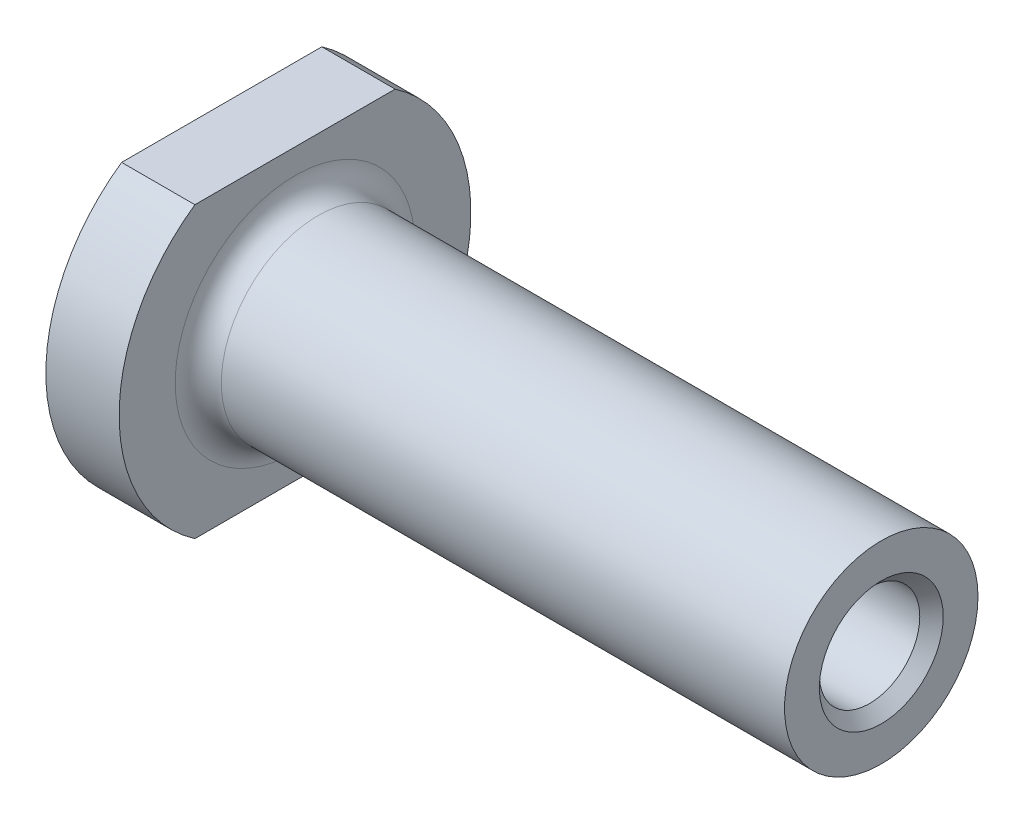
ISO-10303-21;
HEADER;
FILE_DESCRIPTION(('STEP AP214'),'2;1');
FILE_NAME('part.step','',(''),(''),'','','');
FILE_SCHEMA(('AUTOMOTIVE_DESIGN { 1 0 10303 214 1 1 1 1 }'));
ENDSEC;
DATA;
#1=APPLICATION_CONTEXT('core data for automotive mechanical design processes');
#2=APPLICATION_PROTOCOL_DEFINITION('international standard','automotive_design',2000,#1);
#3=PRODUCT_CONTEXT('',#1,'mechanical');
#4=PRODUCT('Part','Part','',(#3));
#5=PRODUCT_RELATED_PRODUCT_CATEGORY('part','',(#4));
#6=PRODUCT_DEFINITION_FORMATION('','',#4);
#7=PRODUCT_DEFINITION_CONTEXT('part definition',#1,'design');
#8=PRODUCT_DEFINITION('design','',#6,#7);
#9=PRODUCT_DEFINITION_SHAPE('','',#8);
#10=(LENGTH_UNIT() NAMED_UNIT(*) SI_UNIT(.MILLI.,.METRE.));
#11=(NAMED_UNIT(*) PLANE_ANGLE_UNIT() SI_UNIT($,.RADIAN.));
#12=(NAMED_UNIT(*) SI_UNIT($,.STERADIAN.) SOLID_ANGLE_UNIT());
#13=UNCERTAINTY_MEASURE_WITH_UNIT(LENGTH_MEASURE(1.E-05),#10,'distance_accuracy_value','');
#14=(GEOMETRIC_REPRESENTATION_CONTEXT(3) GLOBAL_UNCERTAINTY_ASSIGNED_CONTEXT((#13)) GLOBAL_UNIT_ASSIGNED_CONTEXT((#10,
#11,#12)) REPRESENTATION_CONTEXT('',''));
#15=CARTESIAN_POINT('',(0.,0.,0.));
#16=DIRECTION('',(0.,0.,1.));
#17=DIRECTION('',(1.,0.,0.));
#18=AXIS2_PLACEMENT_3D('',#15,#16,#17);
#19=CARTESIAN_POINT('',(0.,0.,0.));
#20=DIRECTION('',(1.,0.,0.));
#21=DIRECTION('',(0.,0.,-1.));
#22=AXIS2_PLACEMENT_3D('',#19,#20,#21);
#23=CYLINDRICAL_SURFACE('',#22,11.43);
#24=DIRECTION('',(1.,0.,0.));
#25=VECTOR('',#24,1.);
#26=CARTESIAN_POINT('',(0.,9.398,-6.50557422523177));
#27=LINE('',#26,#25);
#28=CARTESIAN_POINT('',(4.7625,9.398,-6.50557422523177));
#29=VERTEX_POINT('',#28);
#30=CARTESIAN_POINT('',(0.,9.398,-6.50557422523177));
#31=VERTEX_POINT('',#30);
#32=EDGE_CURVE('E87',#29,#31,#27,.F.);
#33=ORIENTED_EDGE('',*,*,#32,.F.);
#34=CARTESIAN_POINT('',(4.7625,0.,0.));
#35=DIRECTION('',(1.,0.,0.));
#36=DIRECTION('',(0.,0.,-1.));
#37=AXIS2_PLACEMENT_3D('',#34,#35,#36);
#38=CIRCLE('',#37,11.43);
#39=CARTESIAN_POINT('',(4.7625,-9.398,-6.50557422523177));
#40=VERTEX_POINT('',#39);
#41=EDGE_CURVE('E109',#40,#29,#38,.T.);
#42=ORIENTED_EDGE('',*,*,#41,.F.);
#43=DIRECTION('',(1.,0.,0.));
#44=VECTOR('',#43,1.);
#45=CARTESIAN_POINT('',(0.,-9.398,-6.50557422523177));
#46=LINE('',#45,#44);
#47=CARTESIAN_POINT('',(0.,-9.398,-6.50557422523177));
#48=VERTEX_POINT('',#47);
#49=EDGE_CURVE('E107',#48,#40,#46,.T.);
#50=ORIENTED_EDGE('',*,*,#49,.F.);
#51=CARTESIAN_POINT('',(0.,0.,0.));
#52=DIRECTION('',(1.,0.,0.));
#53=DIRECTION('',(0.,0.,-1.));
#54=AXIS2_PLACEMENT_3D('',#51,#52,#53);
#55=CIRCLE('',#54,11.43);
#56=EDGE_CURVE('E102',#48,#31,#55,.T.);
#57=ORIENTED_EDGE('',*,*,#56,.T.);
#58=EDGE_LOOP('',(#33,#42,#50,#57));
#59=FACE_BOUND('',#58,.T.);
#60=ADVANCED_FACE('F47',(#59),#23,.T.);
#61=CARTESIAN_POINT('',(0.,11.43,0.));
#62=DIRECTION('',(-1.,0.,0.));
#63=DIRECTION('',(0.,0.,1.));
#64=AXIS2_PLACEMENT_3D('',#61,#62,#63);
#65=PLANE('',#64);
#66=CARTESIAN_POINT('',(0.,0.,0.));
#67=DIRECTION('',(-1.,0.,0.));
#68=DIRECTION('',(0.,0.,1.));
#69=AXIS2_PLACEMENT_3D('',#66,#67,#68);
#70=CIRCLE('',#69,4.02589999999998);
#71=CARTESIAN_POINT('',(0.,0.,4.02589999999998));
#72=VERTEX_POINT('',#71);
#73=EDGE_CURVE('E95',#72,#72,#70,.F.);
#74=ORIENTED_EDGE('',*,*,#73,.T.);
#75=EDGE_LOOP('',(#74));
#76=FACE_BOUND('',#75,.T.);
#77=DIRECTION('',(0.,0.,1.));
#78=VECTOR('',#77,1.);
#79=CARTESIAN_POINT('',(0.,9.398,-6.50557422523177));
#80=LINE('',#79,#78);
#81=CARTESIAN_POINT('',(0.,9.398,6.50557422523177));
#82=VERTEX_POINT('',#81);
#83=EDGE_CURVE('E71',#31,#82,#80,.T.);
#84=ORIENTED_EDGE('',*,*,#83,.F.);
#85=ORIENTED_EDGE('',*,*,#56,.F.);
#86=DIRECTION('',(0.,0.,-1.));
#87=VECTOR('',#86,1.);
#88=CARTESIAN_POINT('',(0.,-9.398,6.50557422523177));
#89=LINE('',#88,#87);
#90=CARTESIAN_POINT('',(0.,-9.398,6.50557422523177));
#91=VERTEX_POINT('',#90);
#92=EDGE_CURVE('E63',#91,#48,#89,.T.);
#93=ORIENTED_EDGE('',*,*,#92,.F.);
#94=EDGE_CURVE('E104',#82,#91,#55,.T.);
#95=ORIENTED_EDGE('',*,*,#94,.F.);
#96=EDGE_LOOP('',(#84,#85,#93,#95));
#97=FACE_BOUND('',#96,.T.);
#98=ADVANCED_FACE('F101',(#76,#97),#65,.T.);
#99=CARTESIAN_POINT('',(42.8625,0.,0.));
#100=DIRECTION('',(1.,0.,0.));
#101=DIRECTION('',(0.,0.,-1.));
#102=AXIS2_PLACEMENT_3D('',#99,#100,#101);
#103=PLANE('',#102);
#104=CARTESIAN_POINT('',(42.8625,0.,0.));
#105=DIRECTION('',(1.,0.,0.));
#106=DIRECTION('',(0.,0.,-1.));
#107=AXIS2_PLACEMENT_3D('',#104,#105,#106);
#108=CIRCLE('',#107,4.02589999999999);
#109=CARTESIAN_POINT('',(42.8625,0.,-4.02589999999999));
#110=VERTEX_POINT('',#109);
#111=EDGE_CURVE('E11',#110,#110,#108,.F.);
#112=ORIENTED_EDGE('',*,*,#111,.T.);
#113=EDGE_LOOP('',(#112));
#114=FACE_BOUND('',#113,.T.);
#115=CARTESIAN_POINT('',(42.8625,0.,0.));
#116=DIRECTION('',(1.,0.,0.));
#117=DIRECTION('',(0.,0.,-1.));
#118=AXIS2_PLACEMENT_3D('',#115,#116,#117);
#119=CIRCLE('',#118,6.2865);
#120=CARTESIAN_POINT('',(42.8625,0.,-6.2865));
#121=VERTEX_POINT('',#120);
#122=EDGE_CURVE('E115',#121,#121,#119,.T.);
#123=ORIENTED_EDGE('',*,*,#122,.T.);
#124=EDGE_LOOP('',(#123));
#125=FACE_BOUND('',#124,.T.);
#126=ADVANCED_FACE('F144',(#114,#125),#103,.T.);
#127=CARTESIAN_POINT('',(0.,0.,0.));
#128=DIRECTION('',(1.,0.,0.));
#129=DIRECTION('',(0.,0.,-1.));
#130=AXIS2_PLACEMENT_3D('',#127,#128,#129);
#131=CYLINDRICAL_SURFACE('',#130,6.2865);
#132=CARTESIAN_POINT('',(6.2625,0.,0.));
#133=DIRECTION('',(1.,0.,0.));
#134=DIRECTION('',(0.,0.,-1.));
#135=AXIS2_PLACEMENT_3D('',#132,#133,#134);
#136=CIRCLE('',#135,6.2865);
#137=CARTESIAN_POINT('',(6.2625,0.,-6.2865));
#138=VERTEX_POINT('',#137);
#139=EDGE_CURVE('E118',#138,#138,#136,.T.);
#140=ORIENTED_EDGE('',*,*,#139,.T.);
#141=EDGE_LOOP('',(#140));
#142=FACE_BOUND('',#141,.T.);
#143=ORIENTED_EDGE('',*,*,#122,.F.);
#144=EDGE_LOOP('',(#143));
#145=FACE_BOUND('',#144,.T.);
#146=ADVANCED_FACE('F151',(#142,#145),#131,.T.);
#147=CARTESIAN_POINT('',(4.7625,6.2865,0.));
#148=DIRECTION('',(1.,0.,0.));
#149=DIRECTION('',(0.,0.,-1.));
#150=AXIS2_PLACEMENT_3D('',#147,#148,#149);
#151=PLANE('',#150);
#152=DIRECTION('',(0.,0.,-1.));
#153=VECTOR('',#152,1.);
#154=CARTESIAN_POINT('',(4.7625,9.398,0.));
#155=LINE('',#154,#153);
#156=CARTESIAN_POINT('',(4.7625,9.398,6.50557422523177));
#157=VERTEX_POINT('',#156);
#158=EDGE_CURVE('E90',#157,#29,#155,.T.);
#159=ORIENTED_EDGE('',*,*,#158,.F.);
#160=CARTESIAN_POINT('',(4.7625,-9.398,6.50557422523177));
#161=VERTEX_POINT('',#160);
#162=EDGE_CURVE('E114',#157,#161,#38,.T.);
#163=ORIENTED_EDGE('',*,*,#162,.T.);
#164=DIRECTION('',(0.,0.,1.));
#165=VECTOR('',#164,1.);
#166=CARTESIAN_POINT('',(4.7625,-9.398,0.));
#167=LINE('',#166,#165);
#168=EDGE_CURVE('E105',#40,#161,#167,.T.);
#169=ORIENTED_EDGE('',*,*,#168,.F.);
#170=ORIENTED_EDGE('',*,*,#41,.T.);
#171=EDGE_LOOP('',(#159,#163,#169,#170));
#172=FACE_BOUND('',#171,.T.);
#173=CARTESIAN_POINT('',(4.7625,0.,0.));
#174=DIRECTION('',(1.,0.,0.));
#175=DIRECTION('',(0.,0.,-1.));
#176=AXIS2_PLACEMENT_3D('',#173,#174,#175);
#177=CIRCLE('',#176,7.7865);
#178=CARTESIAN_POINT('',(4.7625,0.,-7.7865));
#179=VERTEX_POINT('',#178);
#180=EDGE_CURVE('E121',#179,#179,#177,.F.);
#181=ORIENTED_EDGE('',*,*,#180,.T.);
#182=EDGE_LOOP('',(#181));
#183=FACE_BOUND('',#182,.T.);
#184=ADVANCED_FACE('F174',(#172,#183),#151,.T.);
#185=DIRECTION('',(1.,0.,0.));
#186=VECTOR('',#185,1.);
#187=CARTESIAN_POINT('',(0.,9.398,6.50557422523177));
#188=LINE('',#187,#186);
#189=EDGE_CURVE('E96',#82,#157,#188,.T.);
#190=ORIENTED_EDGE('',*,*,#189,.F.);
#191=ORIENTED_EDGE('',*,*,#94,.T.);
#192=DIRECTION('',(1.,0.,0.));
#193=VECTOR('',#192,1.);
#194=CARTESIAN_POINT('',(0.,-9.398,6.50557422523177));
#195=LINE('',#194,#193);
#196=EDGE_CURVE('E125',#161,#91,#195,.F.);
#197=ORIENTED_EDGE('',*,*,#196,.F.);
#198=ORIENTED_EDGE('',*,*,#162,.F.);
#199=EDGE_LOOP('',(#190,#191,#197,#198));
#200=FACE_BOUND('',#199,.T.);
#201=ADVANCED_FACE('F156',(#200),#23,.T.);
#202=CARTESIAN_POINT('',(6.2625,0.,0.));
#203=DIRECTION('',(1.,0.,0.));
#204=DIRECTION('',(0.,0.,-1.));
#205=AXIS2_PLACEMENT_3D('',#202,#203,#204);
#206=TOROIDAL_SURFACE('',#205,7.7865,1.5);
#207=ORIENTED_EDGE('',*,*,#180,.F.);
#208=EDGE_LOOP('',(#207));
#209=FACE_BOUND('',#208,.T.);
#210=ORIENTED_EDGE('',*,*,#139,.F.);
#211=EDGE_LOOP('',(#210));
#212=FACE_BOUND('',#211,.T.);
#213=ADVANCED_FACE('F159',(#209,#212),#206,.F.);
#214=CARTESIAN_POINT('',(42.8625,0.,0.));
#215=DIRECTION('',(1.,0.,0.));
#216=DIRECTION('',(0.,0.,-1.));
#217=AXIS2_PLACEMENT_3D('',#214,#215,#216);
#218=CYLINDRICAL_SURFACE('',#217,3.26389999999999);
#219=CARTESIAN_POINT('',(0.761999999999999,0.,0.));
#220=DIRECTION('',(-1.,0.,0.));
#221=DIRECTION('',(0.,0.,1.));
#222=AXIS2_PLACEMENT_3D('',#219,#220,#221);
#223=CIRCLE('',#222,3.26389999999999);
#224=CARTESIAN_POINT('',(0.761999999999999,0.,3.26389999999999));
#225=VERTEX_POINT('',#224);
#226=EDGE_CURVE('E56',#225,#225,#223,.T.);
#227=ORIENTED_EDGE('',*,*,#226,.T.);
#228=EDGE_LOOP('',(#227));
#229=FACE_BOUND('',#228,.T.);
#230=CARTESIAN_POINT('',(42.1005,0.,0.));
#231=DIRECTION('',(1.,0.,0.));
#232=DIRECTION('',(0.,0.,-1.));
#233=AXIS2_PLACEMENT_3D('',#230,#231,#232);
#234=CIRCLE('',#233,3.26389999999999);
#235=CARTESIAN_POINT('',(42.1005,0.,-3.26389999999999));
#236=VERTEX_POINT('',#235);
#237=EDGE_CURVE('E130',#236,#236,#234,.T.);
#238=ORIENTED_EDGE('',*,*,#237,.T.);
#239=EDGE_LOOP('',(#238));
#240=FACE_BOUND('',#239,.T.);
#241=ADVANCED_FACE('F135',(#229,#240),#218,.F.);
#242=CARTESIAN_POINT('',(42.8625,-9.398,6.50557422523177));
#243=DIRECTION('',(0.,1.,0.));
#244=DIRECTION('',(0.,0.,1.));
#245=AXIS2_PLACEMENT_3D('',#242,#243,#244);
#246=PLANE('',#245);
#247=ORIENTED_EDGE('',*,*,#168,.T.);
#248=ORIENTED_EDGE('',*,*,#196,.T.);
#249=ORIENTED_EDGE('',*,*,#92,.T.);
#250=ORIENTED_EDGE('',*,*,#49,.T.);
#251=EDGE_LOOP('',(#247,#248,#249,#250));
#252=FACE_BOUND('',#251,.T.);
#253=ADVANCED_FACE('F171',(#252),#246,.F.);
#254=CARTESIAN_POINT('',(42.8625,9.398,-6.50557422523177));
#255=DIRECTION('',(0.,-1.,0.));
#256=DIRECTION('',(0.,0.,-1.));
#257=AXIS2_PLACEMENT_3D('',#254,#255,#256);
#258=PLANE('',#257);
#259=ORIENTED_EDGE('',*,*,#158,.T.);
#260=ORIENTED_EDGE('',*,*,#32,.T.);
#261=ORIENTED_EDGE('',*,*,#83,.T.);
#262=ORIENTED_EDGE('',*,*,#189,.T.);
#263=EDGE_LOOP('',(#259,#260,#261,#262));
#264=FACE_BOUND('',#263,.T.);
#265=ADVANCED_FACE('F88',(#264),#258,.F.);
#266=CARTESIAN_POINT('',(0.,0.,0.));
#267=DIRECTION('',(-1.,0.,0.));
#268=DIRECTION('',(0.,0.,1.));
#269=AXIS2_PLACEMENT_3D('',#266,#267,#268);
#270=CONICAL_SURFACE('',#269,4.02589999999998,0.785398163397444);
#271=ORIENTED_EDGE('',*,*,#226,.F.);
#272=EDGE_LOOP('',(#271));
#273=FACE_BOUND('',#272,.T.);
#274=ORIENTED_EDGE('',*,*,#73,.F.);
#275=EDGE_LOOP('',(#274));
#276=FACE_BOUND('',#275,.T.);
#277=ADVANCED_FACE('F138',(#273,#276),#270,.F.);
#278=CARTESIAN_POINT('',(42.1005,0.,0.));
#279=DIRECTION('',(1.,0.,0.));
#280=DIRECTION('',(0.,0.,-1.));
#281=AXIS2_PLACEMENT_3D('',#278,#279,#280);
#282=CONICAL_SURFACE('',#281,3.26389999999999,0.78539816339744);
#283=ORIENTED_EDGE('',*,*,#111,.F.);
#284=EDGE_LOOP('',(#283));
#285=FACE_BOUND('',#284,.T.);
#286=ORIENTED_EDGE('',*,*,#237,.F.);
#287=EDGE_LOOP('',(#286));
#288=FACE_BOUND('',#287,.T.);
#289=ADVANCED_FACE('F50',(#285,#288),#282,.F.);
#290=CLOSED_SHELL('',(#60,#98,#126,#146,#184,#201,#213,#241,#253,#265,#277,#289));
#291=MANIFOLD_SOLID_BREP('B2',#290);
#292=ADVANCED_BREP_SHAPE_REPRESENTATION('',(#18,#291),#14);
#293=SHAPE_DEFINITION_REPRESENTATION(#9,#292);
ENDSEC;
END-ISO-10303-21;
